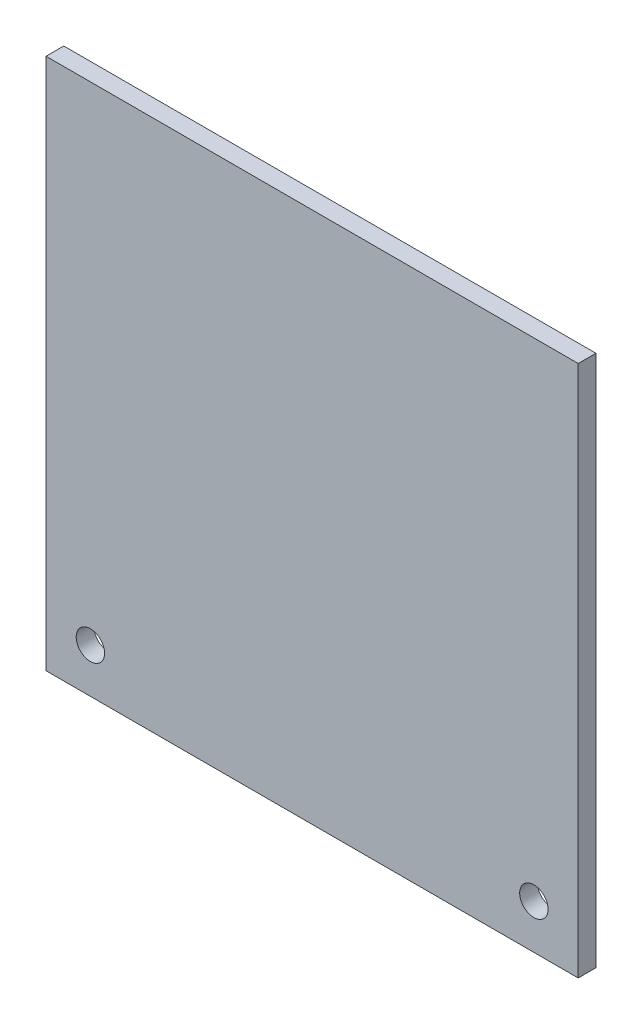
ISO-10303-21;
HEADER;
FILE_DESCRIPTION(('STEP AP214'),'2;1');
FILE_NAME('part.step','',(''),(''),'','','');
FILE_SCHEMA(('AUTOMOTIVE_DESIGN { 1 0 10303 214 1 1 1 1 }'));
ENDSEC;
DATA;
#1=APPLICATION_CONTEXT('core data for automotive mechanical design processes');
#2=APPLICATION_PROTOCOL_DEFINITION('international standard','automotive_design',2000,#1);
#3=PRODUCT_CONTEXT('',#1,'mechanical');
#4=PRODUCT('Part','Part','',(#3));
#5=PRODUCT_RELATED_PRODUCT_CATEGORY('part','',(#4));
#6=PRODUCT_DEFINITION_FORMATION('','',#4);
#7=PRODUCT_DEFINITION_CONTEXT('part definition',#1,'design');
#8=PRODUCT_DEFINITION('design','',#6,#7);
#9=PRODUCT_DEFINITION_SHAPE('','',#8);
#10=(LENGTH_UNIT() NAMED_UNIT(*) SI_UNIT(.MILLI.,.METRE.));
#11=(NAMED_UNIT(*) PLANE_ANGLE_UNIT() SI_UNIT($,.RADIAN.));
#12=(NAMED_UNIT(*) SI_UNIT($,.STERADIAN.) SOLID_ANGLE_UNIT());
#13=UNCERTAINTY_MEASURE_WITH_UNIT(LENGTH_MEASURE(1.E-05),#10,'distance_accuracy_value','');
#14=(GEOMETRIC_REPRESENTATION_CONTEXT(3) GLOBAL_UNCERTAINTY_ASSIGNED_CONTEXT((#13)) GLOBAL_UNIT_ASSIGNED_CONTEXT((#10,
#11,#12)) REPRESENTATION_CONTEXT('',''));
#15=CARTESIAN_POINT('',(0.,0.,0.));
#16=DIRECTION('',(0.,0.,1.));
#17=DIRECTION('',(1.,0.,0.));
#18=AXIS2_PLACEMENT_3D('',#15,#16,#17);
#19=CARTESIAN_POINT('',(0.,0.,2.));
#20=DIRECTION('',(1.,0.,0.));
#21=DIRECTION('',(0.,0.,-1.));
#22=AXIS2_PLACEMENT_3D('',#19,#20,#21);
#23=PLANE('',#22);
#24=DIRECTION('',(0.,-1.,0.));
#25=VECTOR('',#24,1.);
#26=CARTESIAN_POINT('',(0.,0.,0.));
#27=LINE('',#26,#25);
#28=CARTESIAN_POINT('',(0.,60.,0.));
#29=VERTEX_POINT('',#28);
#30=CARTESIAN_POINT('',(0.,0.,0.));
#31=VERTEX_POINT('',#30);
#32=EDGE_CURVE('E98',#29,#31,#27,.T.);
#33=ORIENTED_EDGE('',*,*,#32,.T.);
#34=DIRECTION('',(0.,0.,-1.));
#35=VECTOR('',#34,1.);
#36=CARTESIAN_POINT('',(0.,0.,2.));
#37=LINE('',#36,#35);
#38=CARTESIAN_POINT('',(0.,0.,2.));
#39=VERTEX_POINT('',#38);
#40=EDGE_CURVE('E11',#39,#31,#37,.T.);
#41=ORIENTED_EDGE('',*,*,#40,.F.);
#42=DIRECTION('',(0.,-1.,0.));
#43=VECTOR('',#42,1.);
#44=CARTESIAN_POINT('',(0.,0.,2.));
#45=LINE('',#44,#43);
#46=CARTESIAN_POINT('',(0.,60.,2.));
#47=VERTEX_POINT('',#46);
#48=EDGE_CURVE('E86',#47,#39,#45,.T.);
#49=ORIENTED_EDGE('',*,*,#48,.F.);
#50=DIRECTION('',(0.,0.,-1.));
#51=VECTOR('',#50,1.);
#52=CARTESIAN_POINT('',(0.,60.,2.));
#53=LINE('',#52,#51);
#54=EDGE_CURVE('E94',#47,#29,#53,.T.);
#55=ORIENTED_EDGE('',*,*,#54,.T.);
#56=EDGE_LOOP('',(#33,#41,#49,#55));
#57=FACE_BOUND('',#56,.T.);
#58=ADVANCED_FACE('F35',(#57),#23,.F.);
#59=CARTESIAN_POINT('',(0.,0.,2.));
#60=DIRECTION('',(0.,1.,0.));
#61=DIRECTION('',(0.,0.,1.));
#62=AXIS2_PLACEMENT_3D('',#59,#60,#61);
#63=PLANE('',#62);
#64=DIRECTION('',(1.,0.,0.));
#65=VECTOR('',#64,1.);
#66=CARTESIAN_POINT('',(0.,0.,0.));
#67=LINE('',#66,#65);
#68=CARTESIAN_POINT('',(60.,0.,0.));
#69=VERTEX_POINT('',#68);
#70=EDGE_CURVE('E90',#31,#69,#67,.T.);
#71=ORIENTED_EDGE('',*,*,#70,.T.);
#72=DIRECTION('',(0.,0.,-1.));
#73=VECTOR('',#72,1.);
#74=CARTESIAN_POINT('',(60.,0.,2.));
#75=LINE('',#74,#73);
#76=CARTESIAN_POINT('',(60.,0.,2.));
#77=VERTEX_POINT('',#76);
#78=EDGE_CURVE('E43',#77,#69,#75,.T.);
#79=ORIENTED_EDGE('',*,*,#78,.F.);
#80=DIRECTION('',(1.,0.,0.));
#81=VECTOR('',#80,1.);
#82=CARTESIAN_POINT('',(0.,0.,2.));
#83=LINE('',#82,#81);
#84=EDGE_CURVE('E81',#39,#77,#83,.T.);
#85=ORIENTED_EDGE('',*,*,#84,.F.);
#86=ORIENTED_EDGE('',*,*,#40,.T.);
#87=EDGE_LOOP('',(#71,#79,#85,#86));
#88=FACE_BOUND('',#87,.T.);
#89=ADVANCED_FACE('F89',(#88),#63,.F.);
#90=CARTESIAN_POINT('',(60.,0.,2.));
#91=DIRECTION('',(-1.,0.,0.));
#92=DIRECTION('',(0.,0.,1.));
#93=AXIS2_PLACEMENT_3D('',#90,#91,#92);
#94=PLANE('',#93);
#95=DIRECTION('',(0.,1.,0.));
#96=VECTOR('',#95,1.);
#97=CARTESIAN_POINT('',(60.,0.,0.));
#98=LINE('',#97,#96);
#99=CARTESIAN_POINT('',(60.,60.,0.));
#100=VERTEX_POINT('',#99);
#101=EDGE_CURVE('E68',#69,#100,#98,.T.);
#102=ORIENTED_EDGE('',*,*,#101,.T.);
#103=DIRECTION('',(0.,0.,-1.));
#104=VECTOR('',#103,1.);
#105=CARTESIAN_POINT('',(60.,60.,2.));
#106=LINE('',#105,#104);
#107=CARTESIAN_POINT('',(60.,60.,2.));
#108=VERTEX_POINT('',#107);
#109=EDGE_CURVE('E91',#108,#100,#106,.T.);
#110=ORIENTED_EDGE('',*,*,#109,.F.);
#111=DIRECTION('',(0.,1.,0.));
#112=VECTOR('',#111,1.);
#113=CARTESIAN_POINT('',(60.,0.,2.));
#114=LINE('',#113,#112);
#115=EDGE_CURVE('E84',#77,#108,#114,.T.);
#116=ORIENTED_EDGE('',*,*,#115,.F.);
#117=ORIENTED_EDGE('',*,*,#78,.T.);
#118=EDGE_LOOP('',(#102,#110,#116,#117));
#119=FACE_BOUND('',#118,.T.);
#120=ADVANCED_FACE('F92',(#119),#94,.F.);
#121=CARTESIAN_POINT('',(0.,60.,2.));
#122=DIRECTION('',(0.,-1.,0.));
#123=DIRECTION('',(0.,0.,-1.));
#124=AXIS2_PLACEMENT_3D('',#121,#122,#123);
#125=PLANE('',#124);
#126=DIRECTION('',(-1.,0.,0.));
#127=VECTOR('',#126,1.);
#128=CARTESIAN_POINT('',(0.,60.,0.));
#129=LINE('',#128,#127);
#130=EDGE_CURVE('E74',#100,#29,#129,.T.);
#131=ORIENTED_EDGE('',*,*,#130,.T.);
#132=ORIENTED_EDGE('',*,*,#54,.F.);
#133=DIRECTION('',(-1.,0.,0.));
#134=VECTOR('',#133,1.);
#135=CARTESIAN_POINT('',(0.,60.,2.));
#136=LINE('',#135,#134);
#137=EDGE_CURVE('E51',#108,#47,#136,.T.);
#138=ORIENTED_EDGE('',*,*,#137,.F.);
#139=ORIENTED_EDGE('',*,*,#109,.T.);
#140=EDGE_LOOP('',(#131,#132,#138,#139));
#141=FACE_BOUND('',#140,.T.);
#142=ADVANCED_FACE('F106',(#141),#125,.F.);
#143=CARTESIAN_POINT('',(0.,0.,2.));
#144=DIRECTION('',(0.,0.,-1.));
#145=DIRECTION('',(-1.,0.,0.));
#146=AXIS2_PLACEMENT_3D('',#143,#144,#145);
#147=PLANE('',#146);
#148=CARTESIAN_POINT('',(55.,5.,2.));
#149=DIRECTION('',(0.,0.,-1.));
#150=DIRECTION('',(-1.,0.,0.));
#151=AXIS2_PLACEMENT_3D('',#148,#149,#150);
#152=CIRCLE('',#151,1.6);
#153=CARTESIAN_POINT('',(53.4,5.,2.));
#154=VERTEX_POINT('',#153);
#155=EDGE_CURVE('E117',#154,#154,#152,.T.);
#156=ORIENTED_EDGE('',*,*,#155,.T.);
#157=EDGE_LOOP('',(#156));
#158=FACE_BOUND('',#157,.T.);
#159=CARTESIAN_POINT('',(5.,5.,2.));
#160=DIRECTION('',(0.,0.,-1.));
#161=DIRECTION('',(-1.,0.,0.));
#162=AXIS2_PLACEMENT_3D('',#159,#160,#161);
#163=CIRCLE('',#162,1.6);
#164=CARTESIAN_POINT('',(3.4,5.,2.));
#165=VERTEX_POINT('',#164);
#166=EDGE_CURVE('E101',#165,#165,#163,.T.);
#167=ORIENTED_EDGE('',*,*,#166,.T.);
#168=EDGE_LOOP('',(#167));
#169=FACE_BOUND('',#168,.T.);
#170=ORIENTED_EDGE('',*,*,#48,.T.);
#171=ORIENTED_EDGE('',*,*,#84,.T.);
#172=ORIENTED_EDGE('',*,*,#115,.T.);
#173=ORIENTED_EDGE('',*,*,#137,.T.);
#174=EDGE_LOOP('',(#170,#171,#172,#173));
#175=FACE_BOUND('',#174,.T.);
#176=ADVANCED_FACE('F82',(#158,#169,#175),#147,.F.);
#177=CARTESIAN_POINT('',(0.,0.,0.));
#178=DIRECTION('',(0.,0.,-1.));
#179=DIRECTION('',(-1.,0.,0.));
#180=AXIS2_PLACEMENT_3D('',#177,#178,#179);
#181=PLANE('',#180);
#182=CARTESIAN_POINT('',(55.,5.,0.));
#183=DIRECTION('',(0.,0.,-1.));
#184=DIRECTION('',(-1.,0.,0.));
#185=AXIS2_PLACEMENT_3D('',#182,#183,#184);
#186=CIRCLE('',#185,1.6);
#187=CARTESIAN_POINT('',(53.4,5.,0.));
#188=VERTEX_POINT('',#187);
#189=EDGE_CURVE('E120',#188,#188,#186,.T.);
#190=ORIENTED_EDGE('',*,*,#189,.F.);
#191=EDGE_LOOP('',(#190));
#192=FACE_BOUND('',#191,.T.);
#193=CARTESIAN_POINT('',(5.,5.,0.));
#194=DIRECTION('',(0.,0.,-1.));
#195=DIRECTION('',(-1.,0.,0.));
#196=AXIS2_PLACEMENT_3D('',#193,#194,#195);
#197=CIRCLE('',#196,1.6);
#198=CARTESIAN_POINT('',(3.4,5.,0.));
#199=VERTEX_POINT('',#198);
#200=EDGE_CURVE('E114',#199,#199,#197,.T.);
#201=ORIENTED_EDGE('',*,*,#200,.F.);
#202=EDGE_LOOP('',(#201));
#203=FACE_BOUND('',#202,.T.);
#204=ORIENTED_EDGE('',*,*,#32,.F.);
#205=ORIENTED_EDGE('',*,*,#130,.F.);
#206=ORIENTED_EDGE('',*,*,#101,.F.);
#207=ORIENTED_EDGE('',*,*,#70,.F.);
#208=EDGE_LOOP('',(#204,#205,#206,#207));
#209=FACE_BOUND('',#208,.T.);
#210=ADVANCED_FACE('F109',(#192,#203,#209),#181,.T.);
#211=CARTESIAN_POINT('',(5.,5.,0.));
#212=DIRECTION('',(0.,0.,-1.));
#213=DIRECTION('',(-1.,0.,0.));
#214=AXIS2_PLACEMENT_3D('',#211,#212,#213);
#215=CYLINDRICAL_SURFACE('',#214,1.6);
#216=ORIENTED_EDGE('',*,*,#166,.F.);
#217=EDGE_LOOP('',(#216));
#218=FACE_BOUND('',#217,.T.);
#219=ORIENTED_EDGE('',*,*,#200,.T.);
#220=EDGE_LOOP('',(#219));
#221=FACE_BOUND('',#220,.T.);
#222=ADVANCED_FACE('F128',(#218,#221),#215,.F.);
#223=CARTESIAN_POINT('',(55.,5.,0.));
#224=DIRECTION('',(0.,0.,-1.));
#225=DIRECTION('',(-1.,0.,0.));
#226=AXIS2_PLACEMENT_3D('',#223,#224,#225);
#227=CYLINDRICAL_SURFACE('',#226,1.6);
#228=ORIENTED_EDGE('',*,*,#155,.F.);
#229=EDGE_LOOP('',(#228));
#230=FACE_BOUND('',#229,.T.);
#231=ORIENTED_EDGE('',*,*,#189,.T.);
#232=EDGE_LOOP('',(#231));
#233=FACE_BOUND('',#232,.T.);
#234=ADVANCED_FACE('F124',(#230,#233),#227,.F.);
#235=CLOSED_SHELL('',(#58,#89,#120,#142,#176,#210,#222,#234));
#236=MANIFOLD_SOLID_BREP('B2',#235);
#237=ADVANCED_BREP_SHAPE_REPRESENTATION('',(#18,#236),#14);
#238=SHAPE_DEFINITION_REPRESENTATION(#9,#237);
ENDSEC;
END-ISO-10303-21;
